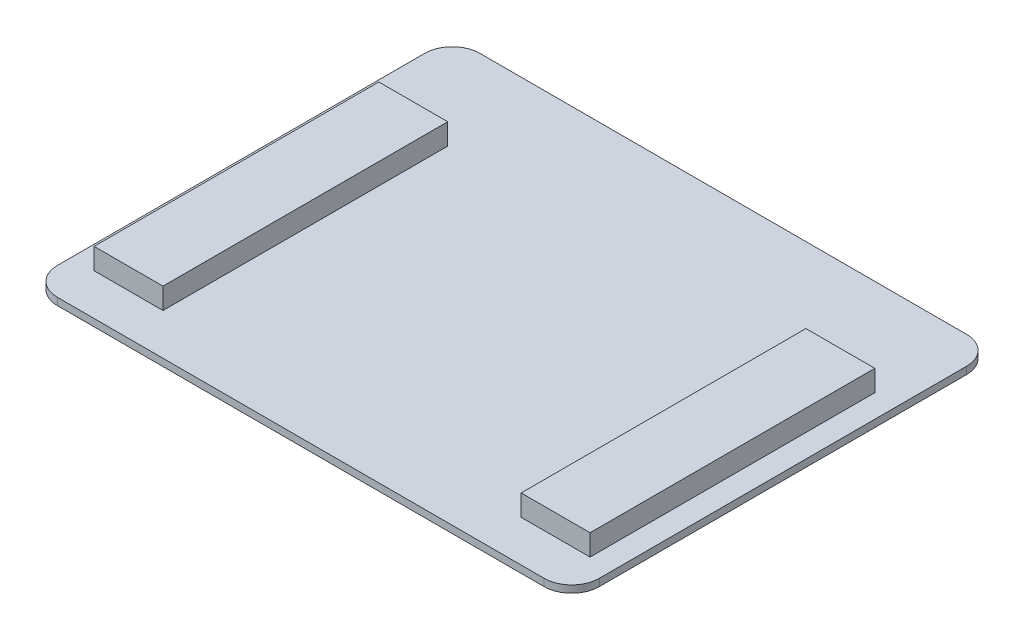
ISO-10303-21;
HEADER;
FILE_DESCRIPTION(('STEP AP214'),'2;1');
FILE_NAME('part.step','',(''),(''),'','','');
FILE_SCHEMA(('AUTOMOTIVE_DESIGN { 1 0 10303 214 1 1 1 1 }'));
ENDSEC;
DATA;
#1=APPLICATION_CONTEXT('core data for automotive mechanical design processes');
#2=APPLICATION_PROTOCOL_DEFINITION('international standard','automotive_design',2000,#1);
#3=PRODUCT_CONTEXT('',#1,'mechanical');
#4=PRODUCT('Part','Part','',(#3));
#5=PRODUCT_RELATED_PRODUCT_CATEGORY('part','',(#4));
#6=PRODUCT_DEFINITION_FORMATION('','',#4);
#7=PRODUCT_DEFINITION_CONTEXT('part definition',#1,'design');
#8=PRODUCT_DEFINITION('design','',#6,#7);
#9=PRODUCT_DEFINITION_SHAPE('','',#8);
#10=(LENGTH_UNIT() NAMED_UNIT(*) SI_UNIT(.MILLI.,.METRE.));
#11=(NAMED_UNIT(*) PLANE_ANGLE_UNIT() SI_UNIT($,.RADIAN.));
#12=(NAMED_UNIT(*) SI_UNIT($,.STERADIAN.) SOLID_ANGLE_UNIT());
#13=UNCERTAINTY_MEASURE_WITH_UNIT(LENGTH_MEASURE(1.E-05),#10,'distance_accuracy_value','');
#14=(GEOMETRIC_REPRESENTATION_CONTEXT(3) GLOBAL_UNCERTAINTY_ASSIGNED_CONTEXT((#13)) GLOBAL_UNIT_ASSIGNED_CONTEXT((#10,
#11,#12)) REPRESENTATION_CONTEXT('',''));
#15=CARTESIAN_POINT('',(0.,0.,0.));
#16=DIRECTION('',(0.,0.,1.));
#17=DIRECTION('',(1.,0.,0.));
#18=AXIS2_PLACEMENT_3D('',#15,#16,#17);
#19=CARTESIAN_POINT('',(0.,2.,0.));
#20=DIRECTION('',(0.,-1.,0.));
#21=DIRECTION('',(0.,0.,-1.));
#22=AXIS2_PLACEMENT_3D('',#19,#20,#21);
#23=PLANE('',#22);
#24=DIRECTION('',(-1.,0.,0.));
#25=VECTOR('',#24,1.);
#26=CARTESIAN_POINT('',(-68.58,2.,46.99));
#27=LINE('',#26,#25);
#28=CARTESIAN_POINT('',(-49.53,2.,46.99));
#29=VERTEX_POINT('',#28);
#30=CARTESIAN_POINT('',(-68.58,2.,46.99));
#31=VERTEX_POINT('',#30);
#32=EDGE_CURVE('E186',#29,#31,#27,.T.);
#33=ORIENTED_EDGE('',*,*,#32,.T.);
#34=DIRECTION('',(0.,0.,-1.));
#35=VECTOR('',#34,1.);
#36=CARTESIAN_POINT('',(-68.58,2.,46.99));
#37=LINE('',#36,#35);
#38=CARTESIAN_POINT('',(-68.58,2.,-31.75));
#39=VERTEX_POINT('',#38);
#40=EDGE_CURVE('E160',#31,#39,#37,.T.);
#41=ORIENTED_EDGE('',*,*,#40,.T.);
#42=DIRECTION('',(1.,0.,0.));
#43=VECTOR('',#42,1.);
#44=CARTESIAN_POINT('',(-68.58,2.,-31.75));
#45=LINE('',#44,#43);
#46=CARTESIAN_POINT('',(-49.53,2.,-31.75));
#47=VERTEX_POINT('',#46);
#48=EDGE_CURVE('E176',#39,#47,#45,.T.);
#49=ORIENTED_EDGE('',*,*,#48,.T.);
#50=DIRECTION('',(0.,0.,1.));
#51=VECTOR('',#50,1.);
#52=CARTESIAN_POINT('',(-49.53,2.,46.99));
#53=LINE('',#52,#51);
#54=EDGE_CURVE('E56',#47,#29,#53,.T.);
#55=ORIENTED_EDGE('',*,*,#54,.T.);
#56=EDGE_LOOP('',(#33,#41,#49,#55));
#57=FACE_BOUND('',#56,.T.);
#58=DIRECTION('',(0.,0.,-1.));
#59=VECTOR('',#58,1.);
#60=CARTESIAN_POINT('',(74.93,2.,-58.42));
#61=LINE('',#60,#59);
#62=CARTESIAN_POINT('',(74.93,2.,50.8));
#63=VERTEX_POINT('',#62);
#64=CARTESIAN_POINT('',(74.93,2.,-50.8));
#65=VERTEX_POINT('',#64);
#66=EDGE_CURVE('E232',#63,#65,#61,.T.);
#67=ORIENTED_EDGE('',*,*,#66,.T.);
#68=CARTESIAN_POINT('',(67.31,2.,-50.8));
#69=DIRECTION('',(0.,-1.,0.));
#70=DIRECTION('',(0.,0.,-1.));
#71=AXIS2_PLACEMENT_3D('',#68,#69,#70);
#72=CIRCLE('',#71,7.62);
#73=CARTESIAN_POINT('',(67.31,2.,-58.42));
#74=VERTEX_POINT('',#73);
#75=EDGE_CURVE('E272',#65,#74,#72,.F.);
#76=ORIENTED_EDGE('',*,*,#75,.T.);
#77=DIRECTION('',(-1.,0.,0.));
#78=VECTOR('',#77,1.);
#79=CARTESIAN_POINT('',(74.93,2.,-58.42));
#80=LINE('',#79,#78);
#81=CARTESIAN_POINT('',(-67.31,2.,-58.42));
#82=VERTEX_POINT('',#81);
#83=EDGE_CURVE('E235',#74,#82,#80,.T.);
#84=ORIENTED_EDGE('',*,*,#83,.T.);
#85=CARTESIAN_POINT('',(-67.31,2.,-50.8));
#86=DIRECTION('',(0.,-1.,0.));
#87=DIRECTION('',(0.,0.,-1.));
#88=AXIS2_PLACEMENT_3D('',#85,#86,#87);
#89=CIRCLE('',#88,7.62);
#90=CARTESIAN_POINT('',(-74.93,2.,-50.8));
#91=VERTEX_POINT('',#90);
#92=EDGE_CURVE('E270',#82,#91,#89,.F.);
#93=ORIENTED_EDGE('',*,*,#92,.T.);
#94=DIRECTION('',(0.,0.,1.));
#95=VECTOR('',#94,1.);
#96=CARTESIAN_POINT('',(-74.93,2.,-58.42));
#97=LINE('',#96,#95);
#98=CARTESIAN_POINT('',(-74.93,2.,50.8));
#99=VERTEX_POINT('',#98);
#100=EDGE_CURVE('E225',#91,#99,#97,.T.);
#101=ORIENTED_EDGE('',*,*,#100,.T.);
#102=CARTESIAN_POINT('',(-67.31,2.,50.8));
#103=DIRECTION('',(0.,-1.,0.));
#104=DIRECTION('',(0.,0.,-1.));
#105=AXIS2_PLACEMENT_3D('',#102,#103,#104);
#106=CIRCLE('',#105,7.62);
#107=CARTESIAN_POINT('',(-67.31,2.,58.42));
#108=VERTEX_POINT('',#107);
#109=EDGE_CURVE('E268',#99,#108,#106,.F.);
#110=ORIENTED_EDGE('',*,*,#109,.T.);
#111=DIRECTION('',(1.,0.,0.));
#112=VECTOR('',#111,1.);
#113=CARTESIAN_POINT('',(74.93,2.,58.42));
#114=LINE('',#113,#112);
#115=CARTESIAN_POINT('',(67.31,2.,58.42));
#116=VERTEX_POINT('',#115);
#117=EDGE_CURVE('E228',#108,#116,#114,.T.);
#118=ORIENTED_EDGE('',*,*,#117,.T.);
#119=CARTESIAN_POINT('',(67.31,2.,50.8));
#120=DIRECTION('',(0.,-1.,0.));
#121=DIRECTION('',(0.,0.,-1.));
#122=AXIS2_PLACEMENT_3D('',#119,#120,#121);
#123=CIRCLE('',#122,7.62);
#124=EDGE_CURVE('E266',#116,#63,#123,.F.);
#125=ORIENTED_EDGE('',*,*,#124,.T.);
#126=EDGE_LOOP('',(#67,#76,#84,#93,#101,#110,#118,#125));
#127=FACE_BOUND('',#126,.T.);
#128=DIRECTION('',(0.,0.,-1.));
#129=VECTOR('',#128,1.);
#130=CARTESIAN_POINT('',(68.58,2.,46.99));
#131=LINE('',#130,#129);
#132=CARTESIAN_POINT('',(68.58,2.,46.99));
#133=VERTEX_POINT('',#132);
#134=CARTESIAN_POINT('',(68.58,2.,-31.75));
#135=VERTEX_POINT('',#134);
#136=EDGE_CURVE('E165',#133,#135,#131,.T.);
#137=ORIENTED_EDGE('',*,*,#136,.F.);
#138=DIRECTION('',(1.,0.,0.));
#139=VECTOR('',#138,1.);
#140=CARTESIAN_POINT('',(68.58,2.,46.99));
#141=LINE('',#140,#139);
#142=CARTESIAN_POINT('',(49.53,2.,46.99));
#143=VERTEX_POINT('',#142);
#144=EDGE_CURVE('E199',#143,#133,#141,.T.);
#145=ORIENTED_EDGE('',*,*,#144,.F.);
#146=DIRECTION('',(0.,0.,1.));
#147=VECTOR('',#146,1.);
#148=CARTESIAN_POINT('',(49.53,2.,46.99));
#149=LINE('',#148,#147);
#150=CARTESIAN_POINT('',(49.53,2.,-31.75));
#151=VERTEX_POINT('',#150);
#152=EDGE_CURVE('E209',#151,#143,#149,.T.);
#153=ORIENTED_EDGE('',*,*,#152,.F.);
#154=DIRECTION('',(-1.,0.,0.));
#155=VECTOR('',#154,1.);
#156=CARTESIAN_POINT('',(68.58,2.,-31.75));
#157=LINE('',#156,#155);
#158=EDGE_CURVE('E64',#135,#151,#157,.T.);
#159=ORIENTED_EDGE('',*,*,#158,.F.);
#160=EDGE_LOOP('',(#137,#145,#153,#159));
#161=FACE_BOUND('',#160,.T.);
#162=ADVANCED_FACE('F41',(#57,#127,#161),#23,.F.);
#163=CARTESIAN_POINT('',(-74.93,2.,-58.42));
#164=DIRECTION('',(1.,0.,0.));
#165=DIRECTION('',(0.,0.,-1.));
#166=AXIS2_PLACEMENT_3D('',#163,#164,#165);
#167=PLANE('',#166);
#168=ORIENTED_EDGE('',*,*,#100,.F.);
#169=DIRECTION('',(0.,-1.,0.));
#170=VECTOR('',#169,1.);
#171=CARTESIAN_POINT('',(-74.93,2.,-50.8));
#172=LINE('',#171,#170);
#173=CARTESIAN_POINT('',(-74.93,0.,-50.8));
#174=VERTEX_POINT('',#173);
#175=EDGE_CURVE('E276',#91,#174,#172,.T.);
#176=ORIENTED_EDGE('',*,*,#175,.T.);
#177=DIRECTION('',(0.,0.,1.));
#178=VECTOR('',#177,1.);
#179=CARTESIAN_POINT('',(-74.93,0.,-58.42));
#180=LINE('',#179,#178);
#181=CARTESIAN_POINT('',(-74.93,0.,50.8));
#182=VERTEX_POINT('',#181);
#183=EDGE_CURVE('E224',#174,#182,#180,.T.);
#184=ORIENTED_EDGE('',*,*,#183,.T.);
#185=DIRECTION('',(0.,-1.,0.));
#186=VECTOR('',#185,1.);
#187=CARTESIAN_POINT('',(-74.93,2.,50.8));
#188=LINE('',#187,#186);
#189=EDGE_CURVE('E274',#182,#99,#188,.F.);
#190=ORIENTED_EDGE('',*,*,#189,.T.);
#191=EDGE_LOOP('',(#168,#176,#184,#190));
#192=FACE_BOUND('',#191,.T.);
#193=ADVANCED_FACE('F312',(#192),#167,.F.);
#194=CARTESIAN_POINT('',(74.93,2.,58.42));
#195=DIRECTION('',(0.,0.,-1.));
#196=DIRECTION('',(-1.,0.,0.));
#197=AXIS2_PLACEMENT_3D('',#194,#195,#196);
#198=PLANE('',#197);
#199=ORIENTED_EDGE('',*,*,#117,.F.);
#200=DIRECTION('',(0.,-1.,0.));
#201=VECTOR('',#200,1.);
#202=CARTESIAN_POINT('',(-67.31,2.,58.42));
#203=LINE('',#202,#201);
#204=CARTESIAN_POINT('',(-67.31,0.,58.42));
#205=VERTEX_POINT('',#204);
#206=EDGE_CURVE('E11',#108,#205,#203,.T.);
#207=ORIENTED_EDGE('',*,*,#206,.T.);
#208=DIRECTION('',(1.,0.,0.));
#209=VECTOR('',#208,1.);
#210=CARTESIAN_POINT('',(74.93,0.,58.42));
#211=LINE('',#210,#209);
#212=CARTESIAN_POINT('',(67.31,0.,58.42));
#213=VERTEX_POINT('',#212);
#214=EDGE_CURVE('E241',#205,#213,#211,.T.);
#215=ORIENTED_EDGE('',*,*,#214,.T.);
#216=DIRECTION('',(0.,-1.,0.));
#217=VECTOR('',#216,1.);
#218=CARTESIAN_POINT('',(67.31,2.,58.42));
#219=LINE('',#218,#217);
#220=EDGE_CURVE('E49',#213,#116,#219,.F.);
#221=ORIENTED_EDGE('',*,*,#220,.T.);
#222=EDGE_LOOP('',(#199,#207,#215,#221));
#223=FACE_BOUND('',#222,.T.);
#224=ADVANCED_FACE('F281',(#223),#198,.F.);
#225=CARTESIAN_POINT('',(74.93,2.,-58.42));
#226=DIRECTION('',(-1.,0.,0.));
#227=DIRECTION('',(0.,0.,1.));
#228=AXIS2_PLACEMENT_3D('',#225,#226,#227);
#229=PLANE('',#228);
#230=DIRECTION('',(0.,0.,-1.));
#231=VECTOR('',#230,1.);
#232=CARTESIAN_POINT('',(74.93,0.,-58.42));
#233=LINE('',#232,#231);
#234=CARTESIAN_POINT('',(74.93,0.,50.8));
#235=VERTEX_POINT('',#234);
#236=CARTESIAN_POINT('',(74.93,0.,-50.8));
#237=VERTEX_POINT('',#236);
#238=EDGE_CURVE('E244',#235,#237,#233,.T.);
#239=ORIENTED_EDGE('',*,*,#238,.T.);
#240=DIRECTION('',(0.,-1.,0.));
#241=VECTOR('',#240,1.);
#242=CARTESIAN_POINT('',(74.93,2.,-50.8));
#243=LINE('',#242,#241);
#244=EDGE_CURVE('E264',#237,#65,#243,.F.);
#245=ORIENTED_EDGE('',*,*,#244,.T.);
#246=ORIENTED_EDGE('',*,*,#66,.F.);
#247=DIRECTION('',(0.,-1.,0.));
#248=VECTOR('',#247,1.);
#249=CARTESIAN_POINT('',(74.93,2.,50.8));
#250=LINE('',#249,#248);
#251=EDGE_CURVE('E261',#63,#235,#250,.T.);
#252=ORIENTED_EDGE('',*,*,#251,.T.);
#253=EDGE_LOOP('',(#239,#245,#246,#252));
#254=FACE_BOUND('',#253,.T.);
#255=ADVANCED_FACE('F292',(#254),#229,.F.);
#256=CARTESIAN_POINT('',(74.93,2.,-58.42));
#257=DIRECTION('',(0.,0.,1.));
#258=DIRECTION('',(1.,0.,0.));
#259=AXIS2_PLACEMENT_3D('',#256,#257,#258);
#260=PLANE('',#259);
#261=ORIENTED_EDGE('',*,*,#83,.F.);
#262=DIRECTION('',(0.,-1.,0.));
#263=VECTOR('',#262,1.);
#264=CARTESIAN_POINT('',(67.31,2.,-58.42));
#265=LINE('',#264,#263);
#266=CARTESIAN_POINT('',(67.31,0.,-58.42));
#267=VERTEX_POINT('',#266);
#268=EDGE_CURVE('E250',#74,#267,#265,.T.);
#269=ORIENTED_EDGE('',*,*,#268,.T.);
#270=DIRECTION('',(-1.,0.,0.));
#271=VECTOR('',#270,1.);
#272=CARTESIAN_POINT('',(74.93,0.,-58.42));
#273=LINE('',#272,#271);
#274=CARTESIAN_POINT('',(-67.31,0.,-58.42));
#275=VERTEX_POINT('',#274);
#276=EDGE_CURVE('E229',#267,#275,#273,.T.);
#277=ORIENTED_EDGE('',*,*,#276,.T.);
#278=DIRECTION('',(0.,-1.,0.));
#279=VECTOR('',#278,1.);
#280=CARTESIAN_POINT('',(-67.31,2.,-58.42));
#281=LINE('',#280,#279);
#282=EDGE_CURVE('E238',#275,#82,#281,.F.);
#283=ORIENTED_EDGE('',*,*,#282,.T.);
#284=EDGE_LOOP('',(#261,#269,#277,#283));
#285=FACE_BOUND('',#284,.T.);
#286=ADVANCED_FACE('F303',(#285),#260,.F.);
#287=CARTESIAN_POINT('',(0.,0.,0.));
#288=DIRECTION('',(0.,-1.,0.));
#289=DIRECTION('',(0.,0.,-1.));
#290=AXIS2_PLACEMENT_3D('',#287,#288,#289);
#291=PLANE('',#290);
#292=ORIENTED_EDGE('',*,*,#276,.F.);
#293=CARTESIAN_POINT('',(67.31,0.,-50.8));
#294=DIRECTION('',(0.,-1.,0.));
#295=DIRECTION('',(0.,0.,-1.));
#296=AXIS2_PLACEMENT_3D('',#293,#294,#295);
#297=CIRCLE('',#296,7.62);
#298=EDGE_CURVE('E259',#267,#237,#297,.T.);
#299=ORIENTED_EDGE('',*,*,#298,.T.);
#300=ORIENTED_EDGE('',*,*,#238,.F.);
#301=CARTESIAN_POINT('',(67.31,0.,50.8));
#302=DIRECTION('',(0.,-1.,0.));
#303=DIRECTION('',(0.,0.,-1.));
#304=AXIS2_PLACEMENT_3D('',#301,#302,#303);
#305=CIRCLE('',#304,7.62);
#306=EDGE_CURVE('E253',#235,#213,#305,.T.);
#307=ORIENTED_EDGE('',*,*,#306,.T.);
#308=ORIENTED_EDGE('',*,*,#214,.F.);
#309=CARTESIAN_POINT('',(-67.31,0.,50.8));
#310=DIRECTION('',(0.,-1.,0.));
#311=DIRECTION('',(0.,0.,-1.));
#312=AXIS2_PLACEMENT_3D('',#309,#310,#311);
#313=CIRCLE('',#312,7.62);
#314=EDGE_CURVE('E255',#205,#182,#313,.T.);
#315=ORIENTED_EDGE('',*,*,#314,.T.);
#316=ORIENTED_EDGE('',*,*,#183,.F.);
#317=CARTESIAN_POINT('',(-67.31,0.,-50.8));
#318=DIRECTION('',(0.,-1.,0.));
#319=DIRECTION('',(0.,0.,-1.));
#320=AXIS2_PLACEMENT_3D('',#317,#318,#319);
#321=CIRCLE('',#320,7.62);
#322=EDGE_CURVE('E257',#174,#275,#321,.T.);
#323=ORIENTED_EDGE('',*,*,#322,.T.);
#324=EDGE_LOOP('',(#292,#299,#300,#307,#308,#315,#316,#323));
#325=FACE_BOUND('',#324,.T.);
#326=ADVANCED_FACE('F296',(#325),#291,.T.);
#327=CARTESIAN_POINT('',(67.31,2.,-50.8));
#328=DIRECTION('',(0.,-1.,0.));
#329=DIRECTION('',(0.,0.,-1.));
#330=AXIS2_PLACEMENT_3D('',#327,#328,#329);
#331=CYLINDRICAL_SURFACE('',#330,7.62);
#332=ORIENTED_EDGE('',*,*,#75,.F.);
#333=ORIENTED_EDGE('',*,*,#244,.F.);
#334=ORIENTED_EDGE('',*,*,#298,.F.);
#335=ORIENTED_EDGE('',*,*,#268,.F.);
#336=EDGE_LOOP('',(#332,#333,#334,#335));
#337=FACE_BOUND('',#336,.T.);
#338=ADVANCED_FACE('F300',(#337),#331,.T.);
#339=CARTESIAN_POINT('',(-67.31,2.,-50.8));
#340=DIRECTION('',(0.,-1.,0.));
#341=DIRECTION('',(0.,0.,-1.));
#342=AXIS2_PLACEMENT_3D('',#339,#340,#341);
#343=CYLINDRICAL_SURFACE('',#342,7.62);
#344=ORIENTED_EDGE('',*,*,#92,.F.);
#345=ORIENTED_EDGE('',*,*,#282,.F.);
#346=ORIENTED_EDGE('',*,*,#322,.F.);
#347=ORIENTED_EDGE('',*,*,#175,.F.);
#348=EDGE_LOOP('',(#344,#345,#346,#347));
#349=FACE_BOUND('',#348,.T.);
#350=ADVANCED_FACE('F309',(#349),#343,.T.);
#351=CARTESIAN_POINT('',(-67.31,2.,50.8));
#352=DIRECTION('',(0.,-1.,0.));
#353=DIRECTION('',(0.,0.,-1.));
#354=AXIS2_PLACEMENT_3D('',#351,#352,#353);
#355=CYLINDRICAL_SURFACE('',#354,7.62);
#356=ORIENTED_EDGE('',*,*,#109,.F.);
#357=ORIENTED_EDGE('',*,*,#189,.F.);
#358=ORIENTED_EDGE('',*,*,#314,.F.);
#359=ORIENTED_EDGE('',*,*,#206,.F.);
#360=EDGE_LOOP('',(#356,#357,#358,#359));
#361=FACE_BOUND('',#360,.T.);
#362=ADVANCED_FACE('F315',(#361),#355,.T.);
#363=CARTESIAN_POINT('',(67.31,2.,50.8));
#364=DIRECTION('',(0.,-1.,0.));
#365=DIRECTION('',(0.,0.,-1.));
#366=AXIS2_PLACEMENT_3D('',#363,#364,#365);
#367=CYLINDRICAL_SURFACE('',#366,7.62);
#368=ORIENTED_EDGE('',*,*,#124,.F.);
#369=ORIENTED_EDGE('',*,*,#220,.F.);
#370=ORIENTED_EDGE('',*,*,#306,.F.);
#371=ORIENTED_EDGE('',*,*,#251,.F.);
#372=EDGE_LOOP('',(#368,#369,#370,#371));
#373=FACE_BOUND('',#372,.T.);
#374=ADVANCED_FACE('F43',(#373),#367,.T.);
#375=CARTESIAN_POINT('',(68.58,7.842,46.99));
#376=DIRECTION('',(-1.,0.,0.));
#377=DIRECTION('',(0.,0.,1.));
#378=AXIS2_PLACEMENT_3D('',#375,#376,#377);
#379=PLANE('',#378);
#380=ORIENTED_EDGE('',*,*,#136,.T.);
#381=DIRECTION('',(0.,-1.,0.));
#382=VECTOR('',#381,1.);
#383=CARTESIAN_POINT('',(68.58,7.842,-31.75));
#384=LINE('',#383,#382);
#385=CARTESIAN_POINT('',(68.58,7.842,-31.75));
#386=VERTEX_POINT('',#385);
#387=EDGE_CURVE('E222',#386,#135,#384,.T.);
#388=ORIENTED_EDGE('',*,*,#387,.F.);
#389=DIRECTION('',(0.,0.,-1.));
#390=VECTOR('',#389,1.);
#391=CARTESIAN_POINT('',(68.58,7.842,46.99));
#392=LINE('',#391,#390);
#393=CARTESIAN_POINT('',(68.58,7.842,46.99));
#394=VERTEX_POINT('',#393);
#395=EDGE_CURVE('E195',#394,#386,#392,.T.);
#396=ORIENTED_EDGE('',*,*,#395,.F.);
#397=DIRECTION('',(0.,-1.,0.));
#398=VECTOR('',#397,1.);
#399=CARTESIAN_POINT('',(68.58,7.842,46.99));
#400=LINE('',#399,#398);
#401=EDGE_CURVE('E205',#394,#133,#400,.T.);
#402=ORIENTED_EDGE('',*,*,#401,.T.);
#403=EDGE_LOOP('',(#380,#388,#396,#402));
#404=FACE_BOUND('',#403,.T.);
#405=ADVANCED_FACE('F321',(#404),#379,.F.);
#406=CARTESIAN_POINT('',(68.58,7.842,-31.75));
#407=DIRECTION('',(0.,0.,1.));
#408=DIRECTION('',(1.,0.,0.));
#409=AXIS2_PLACEMENT_3D('',#406,#407,#408);
#410=PLANE('',#409);
#411=ORIENTED_EDGE('',*,*,#158,.T.);
#412=DIRECTION('',(0.,-1.,0.));
#413=VECTOR('',#412,1.);
#414=CARTESIAN_POINT('',(49.53,7.842,-31.75));
#415=LINE('',#414,#413);
#416=CARTESIAN_POINT('',(49.53,7.842,-31.75));
#417=VERTEX_POINT('',#416);
#418=EDGE_CURVE('E219',#417,#151,#415,.T.);
#419=ORIENTED_EDGE('',*,*,#418,.F.);
#420=DIRECTION('',(-1.,0.,0.));
#421=VECTOR('',#420,1.);
#422=CARTESIAN_POINT('',(68.58,7.842,-31.75));
#423=LINE('',#422,#421);
#424=EDGE_CURVE('E198',#386,#417,#423,.T.);
#425=ORIENTED_EDGE('',*,*,#424,.F.);
#426=ORIENTED_EDGE('',*,*,#387,.T.);
#427=EDGE_LOOP('',(#411,#419,#425,#426));
#428=FACE_BOUND('',#427,.T.);
#429=ADVANCED_FACE('F379',(#428),#410,.F.);
#430=CARTESIAN_POINT('',(49.53,7.842,46.99));
#431=DIRECTION('',(1.,0.,0.));
#432=DIRECTION('',(0.,0.,-1.));
#433=AXIS2_PLACEMENT_3D('',#430,#431,#432);
#434=PLANE('',#433);
#435=ORIENTED_EDGE('',*,*,#152,.T.);
#436=DIRECTION('',(0.,-1.,0.));
#437=VECTOR('',#436,1.);
#438=CARTESIAN_POINT('',(49.53,7.842,46.99));
#439=LINE('',#438,#437);
#440=CARTESIAN_POINT('',(49.53,7.842,46.99));
#441=VERTEX_POINT('',#440);
#442=EDGE_CURVE('E216',#441,#143,#439,.T.);
#443=ORIENTED_EDGE('',*,*,#442,.F.);
#444=DIRECTION('',(0.,0.,1.));
#445=VECTOR('',#444,1.);
#446=CARTESIAN_POINT('',(49.53,7.842,46.99));
#447=LINE('',#446,#445);
#448=EDGE_CURVE('E201',#417,#441,#447,.T.);
#449=ORIENTED_EDGE('',*,*,#448,.F.);
#450=ORIENTED_EDGE('',*,*,#418,.T.);
#451=EDGE_LOOP('',(#435,#443,#449,#450));
#452=FACE_BOUND('',#451,.T.);
#453=ADVANCED_FACE('F387',(#452),#434,.F.);
#454=CARTESIAN_POINT('',(68.58,7.842,46.99));
#455=DIRECTION('',(0.,0.,-1.));
#456=DIRECTION('',(-1.,0.,0.));
#457=AXIS2_PLACEMENT_3D('',#454,#455,#456);
#458=PLANE('',#457);
#459=ORIENTED_EDGE('',*,*,#144,.T.);
#460=ORIENTED_EDGE('',*,*,#401,.F.);
#461=DIRECTION('',(1.,0.,0.));
#462=VECTOR('',#461,1.);
#463=CARTESIAN_POINT('',(68.58,7.842,46.99));
#464=LINE('',#463,#462);
#465=EDGE_CURVE('E203',#441,#394,#464,.T.);
#466=ORIENTED_EDGE('',*,*,#465,.F.);
#467=ORIENTED_EDGE('',*,*,#442,.T.);
#468=EDGE_LOOP('',(#459,#460,#466,#467));
#469=FACE_BOUND('',#468,.T.);
#470=ADVANCED_FACE('F396',(#469),#458,.F.);
#471=CARTESIAN_POINT('',(0.,7.842,0.));
#472=DIRECTION('',(0.,1.,0.));
#473=DIRECTION('',(0.,0.,1.));
#474=AXIS2_PLACEMENT_3D('',#471,#472,#473);
#475=PLANE('',#474);
#476=ORIENTED_EDGE('',*,*,#395,.T.);
#477=ORIENTED_EDGE('',*,*,#424,.T.);
#478=ORIENTED_EDGE('',*,*,#448,.T.);
#479=ORIENTED_EDGE('',*,*,#465,.T.);
#480=EDGE_LOOP('',(#476,#477,#478,#479));
#481=FACE_BOUND('',#480,.T.);
#482=ADVANCED_FACE('F406',(#481),#475,.T.);
#483=CARTESIAN_POINT('',(-68.58,7.842,46.99));
#484=DIRECTION('',(-1.,0.,0.));
#485=DIRECTION('',(0.,0.,1.));
#486=AXIS2_PLACEMENT_3D('',#483,#484,#485);
#487=PLANE('',#486);
#488=ORIENTED_EDGE('',*,*,#40,.F.);
#489=DIRECTION('',(0.,-1.,0.));
#490=VECTOR('',#489,1.);
#491=CARTESIAN_POINT('',(-68.58,7.842,46.99));
#492=LINE('',#491,#490);
#493=CARTESIAN_POINT('',(-68.58,7.842,46.99));
#494=VERTEX_POINT('',#493);
#495=EDGE_CURVE('E154',#494,#31,#492,.T.);
#496=ORIENTED_EDGE('',*,*,#495,.F.);
#497=DIRECTION('',(0.,0.,-1.));
#498=VECTOR('',#497,1.);
#499=CARTESIAN_POINT('',(-68.58,7.842,46.99));
#500=LINE('',#499,#498);
#501=CARTESIAN_POINT('',(-68.58,7.842,-31.75));
#502=VERTEX_POINT('',#501);
#503=EDGE_CURVE('E157',#494,#502,#500,.T.);
#504=ORIENTED_EDGE('',*,*,#503,.T.);
#505=DIRECTION('',(0.,-1.,0.));
#506=VECTOR('',#505,1.);
#507=CARTESIAN_POINT('',(-68.58,7.842,-31.75));
#508=LINE('',#507,#506);
#509=EDGE_CURVE('E184',#502,#39,#508,.T.);
#510=ORIENTED_EDGE('',*,*,#509,.T.);
#511=EDGE_LOOP('',(#488,#496,#504,#510));
#512=FACE_BOUND('',#511,.T.);
#513=ADVANCED_FACE('F156',(#512),#487,.T.);
#514=CARTESIAN_POINT('',(-68.58,7.842,46.99));
#515=DIRECTION('',(0.,0.,1.));
#516=DIRECTION('',(1.,0.,0.));
#517=AXIS2_PLACEMENT_3D('',#514,#515,#516);
#518=PLANE('',#517);
#519=ORIENTED_EDGE('',*,*,#32,.F.);
#520=DIRECTION('',(0.,-1.,0.));
#521=VECTOR('',#520,1.);
#522=CARTESIAN_POINT('',(-49.53,7.842,46.99));
#523=LINE('',#522,#521);
#524=CARTESIAN_POINT('',(-49.53,7.842,46.99));
#525=VERTEX_POINT('',#524);
#526=EDGE_CURVE('E166',#525,#29,#523,.T.);
#527=ORIENTED_EDGE('',*,*,#526,.F.);
#528=DIRECTION('',(-1.,0.,0.));
#529=VECTOR('',#528,1.);
#530=CARTESIAN_POINT('',(-68.58,7.842,46.99));
#531=LINE('',#530,#529);
#532=EDGE_CURVE('E172',#525,#494,#531,.T.);
#533=ORIENTED_EDGE('',*,*,#532,.T.);
#534=ORIENTED_EDGE('',*,*,#495,.T.);
#535=EDGE_LOOP('',(#519,#527,#533,#534));
#536=FACE_BOUND('',#535,.T.);
#537=ADVANCED_FACE('F178',(#536),#518,.T.);
#538=CARTESIAN_POINT('',(-49.53,7.842,46.99));
#539=DIRECTION('',(1.,0.,0.));
#540=DIRECTION('',(0.,0.,-1.));
#541=AXIS2_PLACEMENT_3D('',#538,#539,#540);
#542=PLANE('',#541);
#543=ORIENTED_EDGE('',*,*,#54,.F.);
#544=DIRECTION('',(0.,-1.,0.));
#545=VECTOR('',#544,1.);
#546=CARTESIAN_POINT('',(-49.53,7.842,-31.75));
#547=LINE('',#546,#545);
#548=CARTESIAN_POINT('',(-49.53,7.842,-31.75));
#549=VERTEX_POINT('',#548);
#550=EDGE_CURVE('E192',#549,#47,#547,.T.);
#551=ORIENTED_EDGE('',*,*,#550,.F.);
#552=DIRECTION('',(0.,0.,1.));
#553=VECTOR('',#552,1.);
#554=CARTESIAN_POINT('',(-49.53,7.842,46.99));
#555=LINE('',#554,#553);
#556=EDGE_CURVE('E179',#549,#525,#555,.T.);
#557=ORIENTED_EDGE('',*,*,#556,.T.);
#558=ORIENTED_EDGE('',*,*,#526,.T.);
#559=EDGE_LOOP('',(#543,#551,#557,#558));
#560=FACE_BOUND('',#559,.T.);
#561=ADVANCED_FACE('F431',(#560),#542,.T.);
#562=CARTESIAN_POINT('',(-68.58,7.842,-31.75));
#563=DIRECTION('',(0.,0.,-1.));
#564=DIRECTION('',(-1.,0.,0.));
#565=AXIS2_PLACEMENT_3D('',#562,#563,#564);
#566=PLANE('',#565);
#567=ORIENTED_EDGE('',*,*,#48,.F.);
#568=ORIENTED_EDGE('',*,*,#509,.F.);
#569=DIRECTION('',(1.,0.,0.));
#570=VECTOR('',#569,1.);
#571=CARTESIAN_POINT('',(-68.58,7.842,-31.75));
#572=LINE('',#571,#570);
#573=EDGE_CURVE('E175',#502,#549,#572,.T.);
#574=ORIENTED_EDGE('',*,*,#573,.T.);
#575=ORIENTED_EDGE('',*,*,#550,.T.);
#576=EDGE_LOOP('',(#567,#568,#574,#575));
#577=FACE_BOUND('',#576,.T.);
#578=ADVANCED_FACE('F440',(#577),#566,.T.);
#579=CARTESIAN_POINT('',(0.,7.842,0.));
#580=DIRECTION('',(0.,1.,0.));
#581=DIRECTION('',(0.,0.,1.));
#582=AXIS2_PLACEMENT_3D('',#579,#580,#581);
#583=PLANE('',#582);
#584=ORIENTED_EDGE('',*,*,#503,.F.);
#585=ORIENTED_EDGE('',*,*,#532,.F.);
#586=ORIENTED_EDGE('',*,*,#556,.F.);
#587=ORIENTED_EDGE('',*,*,#573,.F.);
#588=EDGE_LOOP('',(#584,#585,#586,#587));
#589=FACE_BOUND('',#588,.T.);
#590=ADVANCED_FACE('F170',(#589),#583,.T.);
#591=CLOSED_SHELL('',(#162,#193,#224,#255,#286,#326,#338,#350,#362,#374,#405,#429,#453,#470,
#482,#513,#537,#561,#578,#590));
#592=MANIFOLD_SOLID_BREP('B2',#591);
#593=ADVANCED_BREP_SHAPE_REPRESENTATION('',(#18,#592),#14);
#594=SHAPE_DEFINITION_REPRESENTATION(#9,#593);
ENDSEC;
END-ISO-10303-21;
